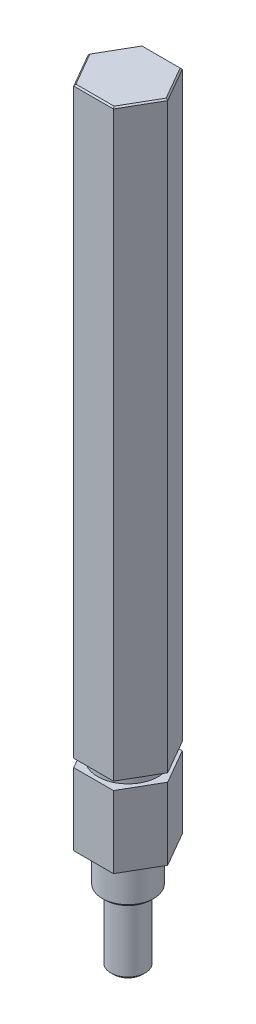
ISO-10303-21;
HEADER;
FILE_DESCRIPTION(('STEP AP214'),'2;1');
FILE_NAME('part.step','',(''),(''),'','','');
FILE_SCHEMA(('AUTOMOTIVE_DESIGN { 1 0 10303 214 1 1 1 1 }'));
ENDSEC;
DATA;
#1=APPLICATION_CONTEXT('core data for automotive mechanical design processes');
#2=APPLICATION_PROTOCOL_DEFINITION('international standard','automotive_design',2000,#1);
#3=PRODUCT_CONTEXT('',#1,'mechanical');
#4=PRODUCT('Part','Part','',(#3));
#5=PRODUCT_RELATED_PRODUCT_CATEGORY('part','',(#4));
#6=PRODUCT_DEFINITION_FORMATION('','',#4);
#7=PRODUCT_DEFINITION_CONTEXT('part definition',#1,'design');
#8=PRODUCT_DEFINITION('design','',#6,#7);
#9=PRODUCT_DEFINITION_SHAPE('','',#8);
#10=(LENGTH_UNIT() NAMED_UNIT(*) SI_UNIT(.MILLI.,.METRE.));
#11=(NAMED_UNIT(*) PLANE_ANGLE_UNIT() SI_UNIT($,.RADIAN.));
#12=(NAMED_UNIT(*) SI_UNIT($,.STERADIAN.) SOLID_ANGLE_UNIT());
#13=UNCERTAINTY_MEASURE_WITH_UNIT(LENGTH_MEASURE(1.E-05),#10,'distance_accuracy_value','');
#14=(GEOMETRIC_REPRESENTATION_CONTEXT(3) GLOBAL_UNCERTAINTY_ASSIGNED_CONTEXT((#13)) GLOBAL_UNIT_ASSIGNED_CONTEXT((#10,
#11,#12)) REPRESENTATION_CONTEXT('',''));
#15=CARTESIAN_POINT('',(0.,0.,0.));
#16=DIRECTION('',(0.,0.,1.));
#17=DIRECTION('',(1.,0.,0.));
#18=AXIS2_PLACEMENT_3D('',#15,#16,#17);
#19=CARTESIAN_POINT('',(-45.6394821348514,-25.4,-16.669011646302));
#20=DIRECTION('',(-0.866025403784438,0.,0.5));
#21=DIRECTION('',(0.5,0.,0.866025403784439));
#22=AXIS2_PLACEMENT_3D('',#19,#20,#21);
#23=PLANE('',#22);
#24=DIRECTION('',(0.5,0.,0.866025403784439));
#25=VECTOR('',#24,1.);
#26=CARTESIAN_POINT('',(-45.6394821348514,-12.1158,-16.669011646302));
#27=LINE('',#26,#25);
#28=CARTESIAN_POINT('',(-45.6394821348514,-12.1158,-16.669011646302));
#29=VERTEX_POINT('',#28);
#30=CARTESIAN_POINT('',(-41.9733079254973,-12.1158,-10.319011646302));
#31=VERTEX_POINT('',#30);
#32=EDGE_CURVE('E258',#29,#31,#27,.T.);
#33=ORIENTED_EDGE('',*,*,#32,.F.);
#34=DIRECTION('',(0.,1.,0.));
#35=VECTOR('',#34,1.);
#36=CARTESIAN_POINT('',(-45.6394821348514,-25.4,-16.669011646302));
#37=LINE('',#36,#35);
#38=CARTESIAN_POINT('',(-45.6394821348514,-25.4,-16.669011646302));
#39=VERTEX_POINT('',#38);
#40=EDGE_CURVE('E294',#39,#29,#37,.T.);
#41=ORIENTED_EDGE('',*,*,#40,.F.);
#42=DIRECTION('',(0.5,0.,0.866025403784439));
#43=VECTOR('',#42,1.);
#44=CARTESIAN_POINT('',(-45.6394821348514,-25.4,-16.669011646302));
#45=LINE('',#44,#43);
#46=CARTESIAN_POINT('',(-41.9733079254973,-25.4,-10.319011646302));
#47=VERTEX_POINT('',#46);
#48=EDGE_CURVE('E278',#39,#47,#45,.T.);
#49=ORIENTED_EDGE('',*,*,#48,.T.);
#50=DIRECTION('',(0.,1.,0.));
#51=VECTOR('',#50,1.);
#52=CARTESIAN_POINT('',(-41.9733079254973,-25.4,-10.319011646302));
#53=LINE('',#52,#51);
#54=EDGE_CURVE('E187',#47,#31,#53,.T.);
#55=ORIENTED_EDGE('',*,*,#54,.T.);
#56=EDGE_LOOP('',(#33,#41,#49,#55));
#57=FACE_BOUND('',#56,.T.);
#58=ADVANCED_FACE('F44',(#57),#23,.T.);
#59=CARTESIAN_POINT('',(-41.9733079254973,-25.4,-10.319011646302));
#60=DIRECTION('',(0.,0.,1.));
#61=DIRECTION('',(1.,0.,0.));
#62=AXIS2_PLACEMENT_3D('',#59,#60,#61);
#63=PLANE('',#62);
#64=DIRECTION('',(1.,0.,0.));
#65=VECTOR('',#64,1.);
#66=CARTESIAN_POINT('',(-41.9733079254973,-12.1158,-10.319011646302));
#67=LINE('',#66,#65);
#68=CARTESIAN_POINT('',(-34.640959506789,-12.1158,-10.319011646302));
#69=VERTEX_POINT('',#68);
#70=EDGE_CURVE('E159',#31,#69,#67,.T.);
#71=ORIENTED_EDGE('',*,*,#70,.F.);
#72=ORIENTED_EDGE('',*,*,#54,.F.);
#73=DIRECTION('',(1.,0.,0.));
#74=VECTOR('',#73,1.);
#75=CARTESIAN_POINT('',(-41.9733079254973,-25.4,-10.319011646302));
#76=LINE('',#75,#74);
#77=CARTESIAN_POINT('',(-34.640959506789,-25.4,-10.319011646302));
#78=VERTEX_POINT('',#77);
#79=EDGE_CURVE('E279',#47,#78,#76,.T.);
#80=ORIENTED_EDGE('',*,*,#79,.T.);
#81=DIRECTION('',(0.,1.,0.));
#82=VECTOR('',#81,1.);
#83=CARTESIAN_POINT('',(-34.640959506789,-25.4,-10.319011646302));
#84=LINE('',#83,#82);
#85=EDGE_CURVE('E181',#78,#69,#84,.T.);
#86=ORIENTED_EDGE('',*,*,#85,.T.);
#87=EDGE_LOOP('',(#71,#72,#80,#86));
#88=FACE_BOUND('',#87,.T.);
#89=ADVANCED_FACE('F352',(#88),#63,.T.);
#90=CARTESIAN_POINT('',(-34.640959506789,-25.4,-10.319011646302));
#91=DIRECTION('',(0.866025403784438,0.,0.500000000000001));
#92=DIRECTION('',(0.500000000000001,0.,-0.866025403784438));
#93=AXIS2_PLACEMENT_3D('',#90,#91,#92);
#94=PLANE('',#93);
#95=DIRECTION('',(0.500000000000001,0.,-0.866025403784438));
#96=VECTOR('',#95,1.);
#97=CARTESIAN_POINT('',(-34.640959506789,-12.1158,-10.319011646302));
#98=LINE('',#97,#96);
#99=CARTESIAN_POINT('',(-30.9747852974349,-12.1158,-16.669011646302));
#100=VERTEX_POINT('',#99);
#101=EDGE_CURVE('E153',#69,#100,#98,.T.);
#102=ORIENTED_EDGE('',*,*,#101,.F.);
#103=ORIENTED_EDGE('',*,*,#85,.F.);
#104=DIRECTION('',(0.500000000000001,0.,-0.866025403784438));
#105=VECTOR('',#104,1.);
#106=CARTESIAN_POINT('',(-34.640959506789,-25.4,-10.319011646302));
#107=LINE('',#106,#105);
#108=CARTESIAN_POINT('',(-30.9747852974349,-25.4,-16.669011646302));
#109=VERTEX_POINT('',#108);
#110=EDGE_CURVE('E175',#78,#109,#107,.T.);
#111=ORIENTED_EDGE('',*,*,#110,.T.);
#112=DIRECTION('',(0.,1.,0.));
#113=VECTOR('',#112,1.);
#114=CARTESIAN_POINT('',(-30.9747852974349,-25.4,-16.669011646302));
#115=LINE('',#114,#113);
#116=EDGE_CURVE('E168',#109,#100,#115,.T.);
#117=ORIENTED_EDGE('',*,*,#116,.T.);
#118=EDGE_LOOP('',(#102,#103,#111,#117));
#119=FACE_BOUND('',#118,.T.);
#120=ADVANCED_FACE('F173',(#119),#94,.T.);
#121=CARTESIAN_POINT('',(-30.9747852974349,-25.4,-16.669011646302));
#122=DIRECTION('',(0.866025403784438,0.,-0.5));
#123=DIRECTION('',(-0.5,0.,-0.866025403784439));
#124=AXIS2_PLACEMENT_3D('',#121,#122,#123);
#125=PLANE('',#124);
#126=DIRECTION('',(-0.5,0.,-0.866025403784439));
#127=VECTOR('',#126,1.);
#128=CARTESIAN_POINT('',(-30.9747852974349,-12.1158,-16.669011646302));
#129=LINE('',#128,#127);
#130=CARTESIAN_POINT('',(-34.640959506789,-12.1158,-23.019011646302));
#131=VERTEX_POINT('',#130);
#132=EDGE_CURVE('E156',#100,#131,#129,.T.);
#133=ORIENTED_EDGE('',*,*,#132,.F.);
#134=ORIENTED_EDGE('',*,*,#116,.F.);
#135=DIRECTION('',(-0.5,0.,-0.866025403784439));
#136=VECTOR('',#135,1.);
#137=CARTESIAN_POINT('',(-30.9747852974349,-25.4,-16.669011646302));
#138=LINE('',#137,#136);
#139=CARTESIAN_POINT('',(-34.640959506789,-25.4,-23.019011646302));
#140=VERTEX_POINT('',#139);
#141=EDGE_CURVE('E283',#109,#140,#138,.T.);
#142=ORIENTED_EDGE('',*,*,#141,.T.);
#143=DIRECTION('',(0.,1.,0.));
#144=VECTOR('',#143,1.);
#145=CARTESIAN_POINT('',(-34.640959506789,-25.4,-23.019011646302));
#146=LINE('',#145,#144);
#147=EDGE_CURVE('E170',#140,#131,#146,.T.);
#148=ORIENTED_EDGE('',*,*,#147,.T.);
#149=EDGE_LOOP('',(#133,#134,#142,#148));
#150=FACE_BOUND('',#149,.T.);
#151=ADVANCED_FACE('F166',(#150),#125,.T.);
#152=CARTESIAN_POINT('',(-34.640959506789,-25.4,-23.019011646302));
#153=DIRECTION('',(0.,0.,-1.));
#154=DIRECTION('',(-1.,0.,0.));
#155=AXIS2_PLACEMENT_3D('',#152,#153,#154);
#156=PLANE('',#155);
#157=DIRECTION('',(-1.,0.,0.));
#158=VECTOR('',#157,1.);
#159=CARTESIAN_POINT('',(-34.640959506789,-12.1158,-23.019011646302));
#160=LINE('',#159,#158);
#161=CARTESIAN_POINT('',(-41.9733079254973,-12.1158,-23.019011646302));
#162=VERTEX_POINT('',#161);
#163=EDGE_CURVE('E171',#131,#162,#160,.T.);
#164=ORIENTED_EDGE('',*,*,#163,.F.);
#165=ORIENTED_EDGE('',*,*,#147,.F.);
#166=DIRECTION('',(-1.,0.,0.));
#167=VECTOR('',#166,1.);
#168=CARTESIAN_POINT('',(-34.640959506789,-25.4,-23.019011646302));
#169=LINE('',#168,#167);
#170=CARTESIAN_POINT('',(-41.9733079254973,-25.4,-23.019011646302));
#171=VERTEX_POINT('',#170);
#172=EDGE_CURVE('E285',#140,#171,#169,.T.);
#173=ORIENTED_EDGE('',*,*,#172,.T.);
#174=DIRECTION('',(0.,1.,0.));
#175=VECTOR('',#174,1.);
#176=CARTESIAN_POINT('',(-41.9733079254973,-25.4,-23.019011646302));
#177=LINE('',#176,#175);
#178=EDGE_CURVE('E297',#171,#162,#177,.T.);
#179=ORIENTED_EDGE('',*,*,#178,.T.);
#180=EDGE_LOOP('',(#164,#165,#173,#179));
#181=FACE_BOUND('',#180,.T.);
#182=ADVANCED_FACE('F460',(#181),#156,.T.);
#183=CARTESIAN_POINT('',(-41.9733079254973,-25.4,-23.019011646302));
#184=DIRECTION('',(-0.866025403784438,0.,-0.5));
#185=DIRECTION('',(-0.5,0.,0.866025403784439));
#186=AXIS2_PLACEMENT_3D('',#183,#184,#185);
#187=PLANE('',#186);
#188=DIRECTION('',(-0.5,0.,0.866025403784439));
#189=VECTOR('',#188,1.);
#190=CARTESIAN_POINT('',(-41.9733079254973,-12.1158,-23.019011646302));
#191=LINE('',#190,#189);
#192=EDGE_CURVE('E202',#162,#29,#191,.T.);
#193=ORIENTED_EDGE('',*,*,#192,.F.);
#194=ORIENTED_EDGE('',*,*,#178,.F.);
#195=DIRECTION('',(-0.5,0.,0.866025403784439));
#196=VECTOR('',#195,1.);
#197=CARTESIAN_POINT('',(-41.9733079254973,-25.4,-23.019011646302));
#198=LINE('',#197,#196);
#199=EDGE_CURVE('E288',#171,#39,#198,.T.);
#200=ORIENTED_EDGE('',*,*,#199,.T.);
#201=ORIENTED_EDGE('',*,*,#40,.T.);
#202=EDGE_LOOP('',(#193,#194,#200,#201));
#203=FACE_BOUND('',#202,.T.);
#204=ADVANCED_FACE('F472',(#203),#187,.T.);
#205=CARTESIAN_POINT('',(-38.3071337161431,-25.4,-3.96901164630201));
#206=DIRECTION('',(0.,1.,0.));
#207=DIRECTION('',(0.,0.,1.));
#208=AXIS2_PLACEMENT_3D('',#205,#206,#207);
#209=PLANE('',#208);
#210=CARTESIAN_POINT('',(-38.3071337161431,-25.4,-16.669011646302));
#211=DIRECTION('',(0.,1.,0.));
#212=DIRECTION('',(1.,0.,0.));
#213=AXIS2_PLACEMENT_3D('',#210,#211,#212);
#214=CIRCLE('',#213,4.7498);
#215=CARTESIAN_POINT('',(-33.5573337161431,-25.4,-16.669011646302));
#216=VERTEX_POINT('',#215);
#217=EDGE_CURVE('E274',#216,#216,#214,.T.);
#218=ORIENTED_EDGE('',*,*,#217,.T.);
#219=EDGE_LOOP('',(#218));
#220=FACE_BOUND('',#219,.T.);
#221=ORIENTED_EDGE('',*,*,#48,.F.);
#222=ORIENTED_EDGE('',*,*,#199,.F.);
#223=ORIENTED_EDGE('',*,*,#172,.F.);
#224=ORIENTED_EDGE('',*,*,#141,.F.);
#225=ORIENTED_EDGE('',*,*,#110,.F.);
#226=ORIENTED_EDGE('',*,*,#79,.F.);
#227=EDGE_LOOP('',(#221,#222,#223,#224,#225,#226));
#228=FACE_BOUND('',#227,.T.);
#229=ADVANCED_FACE('F570',(#220,#228),#209,.F.);
#230=CARTESIAN_POINT('',(-38.3071337161431,-32.512,-16.669011646302));
#231=DIRECTION('',(0.,1.,0.));
#232=DIRECTION('',(0.,0.,1.));
#233=AXIS2_PLACEMENT_3D('',#230,#231,#232);
#234=CYLINDRICAL_SURFACE('',#233,4.7498);
#235=CARTESIAN_POINT('',(-38.3071337161431,-32.004,-16.669011646302));
#236=DIRECTION('',(0.,1.,0.));
#237=DIRECTION('',(0.,0.,1.));
#238=AXIS2_PLACEMENT_3D('',#235,#236,#237);
#239=CIRCLE('',#238,4.7498);
#240=CARTESIAN_POINT('',(-38.3071337161431,-32.004,-11.919211646302));
#241=VERTEX_POINT('',#240);
#242=EDGE_CURVE('E190',#241,#241,#239,.T.);
#243=ORIENTED_EDGE('',*,*,#242,.T.);
#244=EDGE_LOOP('',(#243));
#245=FACE_BOUND('',#244,.T.);
#246=ORIENTED_EDGE('',*,*,#217,.F.);
#247=EDGE_LOOP('',(#246));
#248=FACE_BOUND('',#247,.T.);
#249=ADVANCED_FACE('F560',(#245,#248),#234,.T.);
#250=CARTESIAN_POINT('',(-38.3071337161431,-32.512,-16.669011646302));
#251=DIRECTION('',(0.,1.,0.));
#252=DIRECTION('',(0.,0.,1.));
#253=AXIS2_PLACEMENT_3D('',#250,#251,#252);
#254=PLANE('',#253);
#255=CARTESIAN_POINT('',(-38.3071337161431,-32.512,-16.669011646302));
#256=DIRECTION('',(0.,1.,0.));
#257=DIRECTION('',(0.,0.,1.));
#258=AXIS2_PLACEMENT_3D('',#255,#256,#257);
#259=CIRCLE('',#258,3.1623);
#260=CARTESIAN_POINT('',(-38.3071337161431,-32.512,-13.506711646302));
#261=VERTEX_POINT('',#260);
#262=EDGE_CURVE('E270',#261,#261,#259,.T.);
#263=ORIENTED_EDGE('',*,*,#262,.T.);
#264=EDGE_LOOP('',(#263));
#265=FACE_BOUND('',#264,.T.);
#266=CARTESIAN_POINT('',(-38.3071337161431,-32.512,-16.669011646302));
#267=DIRECTION('',(0.,1.,0.));
#268=DIRECTION('',(0.,0.,1.));
#269=AXIS2_PLACEMENT_3D('',#266,#267,#268);
#270=CIRCLE('',#269,4.2418);
#271=CARTESIAN_POINT('',(-38.3071337161431,-32.512,-12.427211646302));
#272=VERTEX_POINT('',#271);
#273=EDGE_CURVE('E193',#272,#272,#270,.F.);
#274=ORIENTED_EDGE('',*,*,#273,.T.);
#275=EDGE_LOOP('',(#274));
#276=FACE_BOUND('',#275,.T.);
#277=ADVANCED_FACE('F549',(#265,#276),#254,.F.);
#278=CARTESIAN_POINT('',(-38.3071337161431,-32.004,-16.669011646302));
#279=DIRECTION('',(0.,1.,0.));
#280=DIRECTION('',(0.,0.,1.));
#281=AXIS2_PLACEMENT_3D('',#278,#279,#280);
#282=CONICAL_SURFACE('',#281,4.7498,0.785398163397443);
#283=ORIENTED_EDGE('',*,*,#273,.F.);
#284=EDGE_LOOP('',(#283));
#285=FACE_BOUND('',#284,.T.);
#286=ORIENTED_EDGE('',*,*,#242,.F.);
#287=EDGE_LOOP('',(#286));
#288=FACE_BOUND('',#287,.T.);
#289=ADVANCED_FACE('F537',(#285,#288),#282,.T.);
#290=CARTESIAN_POINT('',(-38.3071337161431,-45.212,-16.669011646302));
#291=DIRECTION('',(0.,1.,0.));
#292=DIRECTION('',(0.,0.,1.));
#293=AXIS2_PLACEMENT_3D('',#290,#291,#292);
#294=CYLINDRICAL_SURFACE('',#293,3.1623);
#295=CARTESIAN_POINT('',(-38.3071337161431,-44.704,-16.669011646302));
#296=DIRECTION('',(0.,1.,0.));
#297=DIRECTION('',(0.,0.,1.));
#298=AXIS2_PLACEMENT_3D('',#295,#296,#297);
#299=CIRCLE('',#298,3.1623);
#300=CARTESIAN_POINT('',(-38.3071337161431,-44.704,-13.506711646302));
#301=VERTEX_POINT('',#300);
#302=EDGE_CURVE('E196',#301,#301,#299,.T.);
#303=ORIENTED_EDGE('',*,*,#302,.T.);
#304=EDGE_LOOP('',(#303));
#305=FACE_BOUND('',#304,.T.);
#306=ORIENTED_EDGE('',*,*,#262,.F.);
#307=EDGE_LOOP('',(#306));
#308=FACE_BOUND('',#307,.T.);
#309=ADVANCED_FACE('F526',(#305,#308),#294,.T.);
#310=CARTESIAN_POINT('',(-38.3071337161431,-45.212,-16.669011646302));
#311=DIRECTION('',(0.,1.,0.));
#312=DIRECTION('',(0.,0.,1.));
#313=AXIS2_PLACEMENT_3D('',#310,#311,#312);
#314=PLANE('',#313);
#315=CARTESIAN_POINT('',(-38.3071337161431,-45.212,-16.669011646302));
#316=DIRECTION('',(0.,1.,0.));
#317=DIRECTION('',(0.,0.,1.));
#318=AXIS2_PLACEMENT_3D('',#315,#316,#317);
#319=CIRCLE('',#318,2.6543);
#320=CARTESIAN_POINT('',(-38.3071337161431,-45.212,-14.014711646302));
#321=VERTEX_POINT('',#320);
#322=EDGE_CURVE('E199',#321,#321,#319,.F.);
#323=ORIENTED_EDGE('',*,*,#322,.T.);
#324=EDGE_LOOP('',(#323));
#325=FACE_BOUND('',#324,.T.);
#326=ADVANCED_FACE('F485',(#325),#314,.F.);
#327=CARTESIAN_POINT('',(-38.3071337161431,-44.704,-16.669011646302));
#328=DIRECTION('',(0.,1.,0.));
#329=DIRECTION('',(0.,0.,1.));
#330=AXIS2_PLACEMENT_3D('',#327,#328,#329);
#331=CONICAL_SURFACE('',#330,3.1623,0.785398163397445);
#332=ORIENTED_EDGE('',*,*,#322,.F.);
#333=EDGE_LOOP('',(#332));
#334=FACE_BOUND('',#333,.T.);
#335=ORIENTED_EDGE('',*,*,#302,.F.);
#336=EDGE_LOOP('',(#335));
#337=FACE_BOUND('',#336,.T.);
#338=ADVANCED_FACE('F479',(#334,#337),#331,.T.);
#339=CARTESIAN_POINT('',(-38.3071337161431,-25.4,-16.669011646302));
#340=DIRECTION('',(0.,1.,0.));
#341=DIRECTION('',(0.,0.,1.));
#342=AXIS2_PLACEMENT_3D('',#339,#340,#341);
#343=CYLINDRICAL_SURFACE('',#342,5.58800000000003);
#344=CARTESIAN_POINT('',(-38.3071337161431,-10.6172,-16.669011646302));
#345=DIRECTION('',(0.,1.,0.));
#346=DIRECTION('',(0.,0.,1.));
#347=AXIS2_PLACEMENT_3D('',#344,#345,#346);
#348=CIRCLE('',#347,5.58800000000003);
#349=CARTESIAN_POINT('',(-38.3071337161431,-10.6172,-11.081011646302));
#350=VERTEX_POINT('',#349);
#351=EDGE_CURVE('E249',#350,#350,#348,.T.);
#352=ORIENTED_EDGE('',*,*,#351,.F.);
#353=EDGE_LOOP('',(#352));
#354=FACE_BOUND('',#353,.T.);
#355=CARTESIAN_POINT('',(-38.3071337161431,-12.1158,-16.669011646302));
#356=DIRECTION('',(0.,1.,0.));
#357=DIRECTION('',(0.,0.,1.));
#358=AXIS2_PLACEMENT_3D('',#355,#356,#357);
#359=CIRCLE('',#358,5.58800000000003);
#360=CARTESIAN_POINT('',(-38.3071337161431,-12.1158,-11.081011646302));
#361=VERTEX_POINT('',#360);
#362=EDGE_CURVE('E243',#361,#361,#359,.T.);
#363=ORIENTED_EDGE('',*,*,#362,.T.);
#364=EDGE_LOOP('',(#363));
#365=FACE_BOUND('',#364,.T.);
#366=ADVANCED_FACE('F484',(#354,#365),#343,.T.);
#367=CARTESIAN_POINT('',(-32.7191337161431,-10.6172,-16.669011646302));
#368=DIRECTION('',(0.,1.,0.));
#369=DIRECTION('',(0.,0.,1.));
#370=AXIS2_PLACEMENT_3D('',#367,#368,#369);
#371=PLANE('',#370);
#372=DIRECTION('',(0.5,0.,0.866025403784439));
#373=VECTOR('',#372,1.);
#374=CARTESIAN_POINT('',(-30.9747852974349,-10.6172,-16.669011646302));
#375=LINE('',#374,#373);
#376=CARTESIAN_POINT('',(-34.640959506789,-10.6172,-23.019011646302));
#377=VERTEX_POINT('',#376);
#378=CARTESIAN_POINT('',(-30.9747852974349,-10.6172,-16.669011646302));
#379=VERTEX_POINT('',#378);
#380=EDGE_CURVE('E262',#377,#379,#375,.T.);
#381=ORIENTED_EDGE('',*,*,#380,.T.);
#382=DIRECTION('',(-0.500000000000001,0.,0.866025403784438));
#383=VECTOR('',#382,1.);
#384=CARTESIAN_POINT('',(-34.640959506789,-10.6172,-10.319011646302));
#385=LINE('',#384,#383);
#386=CARTESIAN_POINT('',(-34.640959506789,-10.6172,-10.319011646302));
#387=VERTEX_POINT('',#386);
#388=EDGE_CURVE('E264',#379,#387,#385,.T.);
#389=ORIENTED_EDGE('',*,*,#388,.T.);
#390=DIRECTION('',(-1.,0.,0.));
#391=VECTOR('',#390,1.);
#392=CARTESIAN_POINT('',(-41.9733079254973,-10.6172,-10.319011646302));
#393=LINE('',#392,#391);
#394=CARTESIAN_POINT('',(-41.9733079254973,-10.6172,-10.319011646302));
#395=VERTEX_POINT('',#394);
#396=EDGE_CURVE('E266',#387,#395,#393,.T.);
#397=ORIENTED_EDGE('',*,*,#396,.T.);
#398=DIRECTION('',(-0.5,0.,-0.866025403784439));
#399=VECTOR('',#398,1.);
#400=CARTESIAN_POINT('',(-45.6394821348514,-10.6172,-16.669011646302));
#401=LINE('',#400,#399);
#402=CARTESIAN_POINT('',(-45.6394821348514,-10.6172,-16.669011646302));
#403=VERTEX_POINT('',#402);
#404=EDGE_CURVE('E268',#395,#403,#401,.T.);
#405=ORIENTED_EDGE('',*,*,#404,.T.);
#406=DIRECTION('',(0.5,0.,-0.866025403784439));
#407=VECTOR('',#406,1.);
#408=CARTESIAN_POINT('',(-41.9733079254973,-10.6172,-23.019011646302));
#409=LINE('',#408,#407);
#410=CARTESIAN_POINT('',(-41.9733079254973,-10.6172,-23.019011646302));
#411=VERTEX_POINT('',#410);
#412=EDGE_CURVE('E204',#403,#411,#409,.T.);
#413=ORIENTED_EDGE('',*,*,#412,.T.);
#414=DIRECTION('',(1.,0.,0.));
#415=VECTOR('',#414,1.);
#416=CARTESIAN_POINT('',(-34.640959506789,-10.6172,-23.019011646302));
#417=LINE('',#416,#415);
#418=EDGE_CURVE('E260',#411,#377,#417,.T.);
#419=ORIENTED_EDGE('',*,*,#418,.T.);
#420=EDGE_LOOP('',(#381,#389,#397,#405,#413,#419));
#421=FACE_BOUND('',#420,.T.);
#422=ORIENTED_EDGE('',*,*,#351,.T.);
#423=EDGE_LOOP('',(#422));
#424=FACE_BOUND('',#423,.T.);
#425=ADVANCED_FACE('F498',(#421,#424),#371,.F.);
#426=CARTESIAN_POINT('',(-21.7881364409388,-12.1158,-16.669011646302));
#427=DIRECTION('',(0.,-1.,0.));
#428=DIRECTION('',(0.,0.,-1.));
#429=AXIS2_PLACEMENT_3D('',#426,#427,#428);
#430=PLANE('',#429);
#431=ORIENTED_EDGE('',*,*,#362,.F.);
#432=EDGE_LOOP('',(#431));
#433=FACE_BOUND('',#432,.T.);
#434=ORIENTED_EDGE('',*,*,#32,.T.);
#435=ORIENTED_EDGE('',*,*,#70,.T.);
#436=ORIENTED_EDGE('',*,*,#101,.T.);
#437=ORIENTED_EDGE('',*,*,#132,.T.);
#438=ORIENTED_EDGE('',*,*,#163,.T.);
#439=ORIENTED_EDGE('',*,*,#192,.T.);
#440=EDGE_LOOP('',(#434,#435,#436,#437,#438,#439));
#441=FACE_BOUND('',#440,.T.);
#442=ADVANCED_FACE('F155',(#433,#441),#430,.F.);
#443=CARTESIAN_POINT('',(-45.6394821348514,96.8273399999984,-16.669011646302));
#444=VERTEX_POINT('',#443);
#445=EDGE_CURVE('E291',#403,#444,#37,.T.);
#446=ORIENTED_EDGE('',*,*,#445,.T.);
#447=DIRECTION('',(0.5,0.,-0.866025403784439));
#448=VECTOR('',#447,1.);
#449=CARTESIAN_POINT('',(-41.9733079254972,96.8273399999984,-23.0190116463021));
#450=LINE('',#449,#448);
#451=CARTESIAN_POINT('',(-41.9733079254973,96.8273399999983,-23.019011646302));
#452=VERTEX_POINT('',#451);
#453=EDGE_CURVE('E224',#444,#452,#450,.T.);
#454=ORIENTED_EDGE('',*,*,#453,.T.);
#455=EDGE_CURVE('E296',#411,#452,#177,.T.);
#456=ORIENTED_EDGE('',*,*,#455,.F.);
#457=ORIENTED_EDGE('',*,*,#412,.F.);
#458=EDGE_LOOP('',(#446,#454,#456,#457));
#459=FACE_BOUND('',#458,.T.);
#460=ADVANCED_FACE('F339',(#459),#187,.T.);
#461=ORIENTED_EDGE('',*,*,#455,.T.);
#462=DIRECTION('',(1.,0.,0.));
#463=VECTOR('',#462,1.);
#464=CARTESIAN_POINT('',(-34.6409595067889,96.8273399999984,-23.019011646302));
#465=LINE('',#464,#463);
#466=CARTESIAN_POINT('',(-34.640959506789,96.8273399999984,-23.019011646302));
#467=VERTEX_POINT('',#466);
#468=EDGE_CURVE('E68',#452,#467,#465,.T.);
#469=ORIENTED_EDGE('',*,*,#468,.T.);
#470=EDGE_CURVE('E299',#377,#467,#146,.T.);
#471=ORIENTED_EDGE('',*,*,#470,.F.);
#472=ORIENTED_EDGE('',*,*,#418,.F.);
#473=EDGE_LOOP('',(#461,#469,#471,#472));
#474=FACE_BOUND('',#473,.T.);
#475=ADVANCED_FACE('F303',(#474),#156,.T.);
#476=ORIENTED_EDGE('',*,*,#470,.T.);
#477=DIRECTION('',(0.5,0.,0.866025403784439));
#478=VECTOR('',#477,1.);
#479=CARTESIAN_POINT('',(-30.9747852974349,96.8273399999984,-16.669011646302));
#480=LINE('',#479,#478);
#481=CARTESIAN_POINT('',(-30.9747852974349,96.8273399999984,-16.669011646302));
#482=VERTEX_POINT('',#481);
#483=EDGE_CURVE('E53',#467,#482,#480,.T.);
#484=ORIENTED_EDGE('',*,*,#483,.T.);
#485=EDGE_CURVE('E178',#379,#482,#115,.T.);
#486=ORIENTED_EDGE('',*,*,#485,.F.);
#487=ORIENTED_EDGE('',*,*,#380,.F.);
#488=EDGE_LOOP('',(#476,#484,#486,#487));
#489=FACE_BOUND('',#488,.T.);
#490=ADVANCED_FACE('F436',(#489),#125,.T.);
#491=ORIENTED_EDGE('',*,*,#485,.T.);
#492=DIRECTION('',(-0.500000000000001,0.,0.866025403784438));
#493=VECTOR('',#492,1.);
#494=CARTESIAN_POINT('',(-34.640959506789,96.8273399999984,-10.3190116463021));
#495=LINE('',#494,#493);
#496=CARTESIAN_POINT('',(-34.640959506789,96.8273399999984,-10.319011646302));
#497=VERTEX_POINT('',#496);
#498=EDGE_CURVE('E11',#482,#497,#495,.T.);
#499=ORIENTED_EDGE('',*,*,#498,.T.);
#500=EDGE_CURVE('E177',#387,#497,#84,.T.);
#501=ORIENTED_EDGE('',*,*,#500,.F.);
#502=ORIENTED_EDGE('',*,*,#388,.F.);
#503=EDGE_LOOP('',(#491,#499,#501,#502));
#504=FACE_BOUND('',#503,.T.);
#505=ADVANCED_FACE('F317',(#504),#94,.T.);
#506=ORIENTED_EDGE('',*,*,#500,.T.);
#507=DIRECTION('',(-1.,0.,0.));
#508=VECTOR('',#507,1.);
#509=CARTESIAN_POINT('',(-41.9733079254972,96.8273399999984,-10.319011646302));
#510=LINE('',#509,#508);
#511=CARTESIAN_POINT('',(-41.9733079254973,96.8273399999984,-10.319011646302));
#512=VERTEX_POINT('',#511);
#513=EDGE_CURVE('E219',#497,#512,#510,.T.);
#514=ORIENTED_EDGE('',*,*,#513,.T.);
#515=EDGE_CURVE('E186',#395,#512,#53,.T.);
#516=ORIENTED_EDGE('',*,*,#515,.F.);
#517=ORIENTED_EDGE('',*,*,#396,.F.);
#518=EDGE_LOOP('',(#506,#514,#516,#517));
#519=FACE_BOUND('',#518,.T.);
#520=ADVANCED_FACE('F322',(#519),#63,.T.);
#521=ORIENTED_EDGE('',*,*,#515,.T.);
#522=DIRECTION('',(-0.5,0.,-0.866025403784439));
#523=VECTOR('',#522,1.);
#524=CARTESIAN_POINT('',(-45.6394821348514,96.8273399999984,-16.669011646302));
#525=LINE('',#524,#523);
#526=EDGE_CURVE('E222',#512,#444,#525,.T.);
#527=ORIENTED_EDGE('',*,*,#526,.T.);
#528=ORIENTED_EDGE('',*,*,#445,.F.);
#529=ORIENTED_EDGE('',*,*,#404,.F.);
#530=EDGE_LOOP('',(#521,#527,#528,#529));
#531=FACE_BOUND('',#530,.T.);
#532=ADVANCED_FACE('F337',(#531),#23,.T.);
#533=CARTESIAN_POINT('',(-38.3071337160929,97.0813399999984,-16.669011646288));
#534=DIRECTION('',(0.,1.,0.));
#535=DIRECTION('',(-0.500000000000001,0.,0.866025403784438));
#536=AXIS2_PLACEMENT_3D('',#533,#534,#535);
#537=PLANE('',#536);
#538=DIRECTION('',(0.5,0.,0.866025403784439));
#539=VECTOR('',#538,1.);
#540=CARTESIAN_POINT('',(-43.5864245775945,97.0813399999984,-13.6210116462698));
#541=LINE('',#540,#539);
#542=CARTESIAN_POINT('',(-45.3461881981031,97.0813399999984,-16.669011646302));
#543=VERTEX_POINT('',#542);
#544=CARTESIAN_POINT('',(-41.8266609571231,97.0813399999984,-10.573011646302));
#545=VERTEX_POINT('',#544);
#546=EDGE_CURVE('E214',#543,#545,#541,.T.);
#547=ORIENTED_EDGE('',*,*,#546,.T.);
#548=DIRECTION('',(1.,0.,0.));
#549=VECTOR('',#548,1.);
#550=CARTESIAN_POINT('',(-38.3071337160929,97.0813399999984,-10.573011646302));
#551=LINE('',#550,#549);
#552=CARTESIAN_POINT('',(-34.7876064751632,97.0813399999984,-10.573011646302));
#553=VERTEX_POINT('',#552);
#554=EDGE_CURVE('E216',#545,#553,#551,.T.);
#555=ORIENTED_EDGE('',*,*,#554,.T.);
#556=DIRECTION('',(0.500000000000001,0.,-0.866025403784438));
#557=VECTOR('',#556,1.);
#558=CARTESIAN_POINT('',(-33.0278428546667,97.0813399999984,-13.6210116463133));
#559=LINE('',#558,#557);
#560=CARTESIAN_POINT('',(-31.2680792341832,97.0813399999984,-16.669011646302));
#561=VERTEX_POINT('',#560);
#562=EDGE_CURVE('E206',#553,#561,#559,.T.);
#563=ORIENTED_EDGE('',*,*,#562,.T.);
#564=DIRECTION('',(-0.5,0.,-0.866025403784439));
#565=VECTOR('',#564,1.);
#566=CARTESIAN_POINT('',(-33.0278428546546,97.0813399999984,-19.7170116462698));
#567=LINE('',#566,#565);
#568=CARTESIAN_POINT('',(-34.7876064751632,97.0813399999983,-22.765011646302));
#569=VERTEX_POINT('',#568);
#570=EDGE_CURVE('E208',#561,#569,#567,.T.);
#571=ORIENTED_EDGE('',*,*,#570,.T.);
#572=DIRECTION('',(-1.,0.,0.));
#573=VECTOR('',#572,1.);
#574=CARTESIAN_POINT('',(-38.3071337160929,97.0813399999984,-22.765011646302));
#575=LINE('',#574,#573);
#576=CARTESIAN_POINT('',(-41.8266609571231,97.0813399999984,-22.765011646302));
#577=VERTEX_POINT('',#576);
#578=EDGE_CURVE('E210',#569,#577,#575,.T.);
#579=ORIENTED_EDGE('',*,*,#578,.T.);
#580=DIRECTION('',(-0.5,0.,0.866025403784439));
#581=VECTOR('',#580,1.);
#582=CARTESIAN_POINT('',(-43.5864245776066,97.0813399999984,-19.7170116463133));
#583=LINE('',#582,#581);
#584=EDGE_CURVE('E212',#577,#543,#583,.T.);
#585=ORIENTED_EDGE('',*,*,#584,.T.);
#586=EDGE_LOOP('',(#547,#555,#563,#571,#579,#585));
#587=FACE_BOUND('',#586,.T.);
#588=ADVANCED_FACE('F342',(#587),#537,.T.);
#589=CARTESIAN_POINT('',(-38.3071337160929,97.0813399999984,-22.765011646302));
#590=DIRECTION('',(0.,-0.70710678118657,0.707106781186525));
#591=DIRECTION('',(0.,-0.707106781186525,-0.70710678118657));
#592=AXIS2_PLACEMENT_3D('',#589,#590,#591);
#593=PLANE('',#592);
#594=DIRECTION('',(-0.377964473009231,0.654653670707955,0.654653670707997));
#595=VECTOR('',#594,1.);
#596=CARTESIAN_POINT('',(-35.2903960810228,97.9521971428647,-21.8941545034356));
#597=LINE('',#596,#595);
#598=EDGE_CURVE('E237',#467,#569,#597,.T.);
#599=ORIENTED_EDGE('',*,*,#598,.F.);
#600=ORIENTED_EDGE('',*,*,#468,.F.);
#601=DIRECTION('',(0.377964473009233,0.654653670707954,0.654653670707997));
#602=VECTOR('',#601,1.);
#603=CARTESIAN_POINT('',(-41.3238713512616,97.9521971428679,-21.8941545034324));
#604=LINE('',#603,#602);
#605=EDGE_CURVE('E48',#577,#452,#604,.F.);
#606=ORIENTED_EDGE('',*,*,#605,.F.);
#607=ORIENTED_EDGE('',*,*,#578,.F.);
#608=EDGE_LOOP('',(#599,#600,#606,#607));
#609=FACE_BOUND('',#608,.T.);
#610=ADVANCED_FACE('F46',(#609),#593,.F.);
#611=CARTESIAN_POINT('',(-43.5864245776066,97.0813399999984,-19.7170116463133));
#612=DIRECTION('',(0.612372435695776,-0.707106781186568,0.353553390593264));
#613=DIRECTION('',(0.755928946018474,0.654653670707955,0.));
#614=AXIS2_PLACEMENT_3D('',#611,#612,#613);
#615=PLANE('',#614);
#616=ORIENTED_EDGE('',*,*,#605,.T.);
#617=ORIENTED_EDGE('',*,*,#453,.F.);
#618=DIRECTION('',(0.755928946018478,0.65465367070795,0.));
#619=VECTOR('',#618,1.);
#620=CARTESIAN_POINT('',(-44.3406089863907,97.9521971428588,-16.669011646302));
#621=LINE('',#620,#619);
#622=EDGE_CURVE('E235',#543,#444,#621,.F.);
#623=ORIENTED_EDGE('',*,*,#622,.F.);
#624=ORIENTED_EDGE('',*,*,#584,.F.);
#625=EDGE_LOOP('',(#616,#617,#623,#624));
#626=FACE_BOUND('',#625,.T.);
#627=ADVANCED_FACE('F340',(#626),#615,.F.);
#628=CARTESIAN_POINT('',(-33.0278428546546,97.0813399999984,-19.7170116462698));
#629=DIRECTION('',(-0.612372435695778,-0.707106781186566,0.353553390593265));
#630=DIRECTION('',(0.755928946018472,-0.654653670707957,0.));
#631=AXIS2_PLACEMENT_3D('',#628,#629,#630);
#632=PLANE('',#631);
#633=ORIENTED_EDGE('',*,*,#598,.T.);
#634=ORIENTED_EDGE('',*,*,#570,.F.);
#635=DIRECTION('',(-0.755928946018472,0.654653670707957,0.));
#636=VECTOR('',#635,1.);
#637=CARTESIAN_POINT('',(-32.2736584458881,97.9521971428523,-16.669011646302));
#638=LINE('',#637,#636);
#639=EDGE_CURVE('E232',#482,#561,#638,.T.);
#640=ORIENTED_EDGE('',*,*,#639,.F.);
#641=ORIENTED_EDGE('',*,*,#483,.F.);
#642=EDGE_LOOP('',(#633,#634,#640,#641));
#643=FACE_BOUND('',#642,.T.);
#644=ADVANCED_FACE('F309',(#643),#632,.F.);
#645=CARTESIAN_POINT('',(-43.5864245775945,97.0813399999984,-13.6210116462698));
#646=DIRECTION('',(0.612372435695768,-0.707106781186578,-0.353553390593258));
#647=DIRECTION('',(0.755928946018482,0.654653670707945,0.));
#648=AXIS2_PLACEMENT_3D('',#645,#646,#647);
#649=PLANE('',#648);
#650=ORIENTED_EDGE('',*,*,#622,.T.);
#651=ORIENTED_EDGE('',*,*,#526,.F.);
#652=DIRECTION('',(0.377964473009261,0.654653670707953,-0.654653670707982));
#653=VECTOR('',#652,1.);
#654=CARTESIAN_POINT('',(-41.3238713512741,97.9521971428462,-11.4438687891499));
#655=LINE('',#654,#653);
#656=EDGE_CURVE('E230',#545,#512,#655,.F.);
#657=ORIENTED_EDGE('',*,*,#656,.F.);
#658=ORIENTED_EDGE('',*,*,#546,.F.);
#659=EDGE_LOOP('',(#650,#651,#657,#658));
#660=FACE_BOUND('',#659,.T.);
#661=ADVANCED_FACE('F332',(#660),#649,.F.);
#662=CARTESIAN_POINT('',(-33.0278428546667,97.0813399999984,-13.6210116463133));
#663=DIRECTION('',(-0.612372435695778,-0.707106781186567,-0.353553390593264));
#664=DIRECTION('',(0.755928946018472,-0.654653670707957,0.));
#665=AXIS2_PLACEMENT_3D('',#662,#663,#664);
#666=PLANE('',#665);
#667=ORIENTED_EDGE('',*,*,#639,.T.);
#668=ORIENTED_EDGE('',*,*,#562,.F.);
#669=DIRECTION('',(0.377964473009241,-0.654653670707959,0.654653670707988));
#670=VECTOR('',#669,1.);
#671=CARTESIAN_POINT('',(-35.2903960810193,97.9521971428587,-11.4438687891624));
#672=LINE('',#671,#670);
#673=EDGE_CURVE('E228',#497,#553,#672,.F.);
#674=ORIENTED_EDGE('',*,*,#673,.F.);
#675=ORIENTED_EDGE('',*,*,#498,.F.);
#676=EDGE_LOOP('',(#667,#668,#674,#675));
#677=FACE_BOUND('',#676,.T.);
#678=ADVANCED_FACE('F314',(#677),#666,.F.);
#679=CARTESIAN_POINT('',(-38.3071337160929,97.0813399999984,-10.573011646302));
#680=DIRECTION('',(0.,-0.707106781186563,-0.707106781186532));
#681=DIRECTION('',(0.,0.707106781186532,-0.707106781186563));
#682=AXIS2_PLACEMENT_3D('',#679,#680,#681);
#683=PLANE('',#682);
#684=ORIENTED_EDGE('',*,*,#656,.T.);
#685=ORIENTED_EDGE('',*,*,#513,.F.);
#686=ORIENTED_EDGE('',*,*,#673,.T.);
#687=ORIENTED_EDGE('',*,*,#554,.F.);
#688=EDGE_LOOP('',(#684,#685,#686,#687));
#689=FACE_BOUND('',#688,.T.);
#690=ADVANCED_FACE('F326',(#689),#683,.F.);
#691=CLOSED_SHELL('',(#58,#89,#120,#151,#182,#204,#229,#249,#277,#289,#309,#326,#338,#366,#425,
#442,#460,#475,#490,#505,#520,#532,#588,#610,#627,#644,#661,#678,#690));
#692=MANIFOLD_SOLID_BREP('B2',#691);
#693=ADVANCED_BREP_SHAPE_REPRESENTATION('',(#18,#692),#14);
#694=SHAPE_DEFINITION_REPRESENTATION(#9,#693);
ENDSEC;
END-ISO-10303-21;
